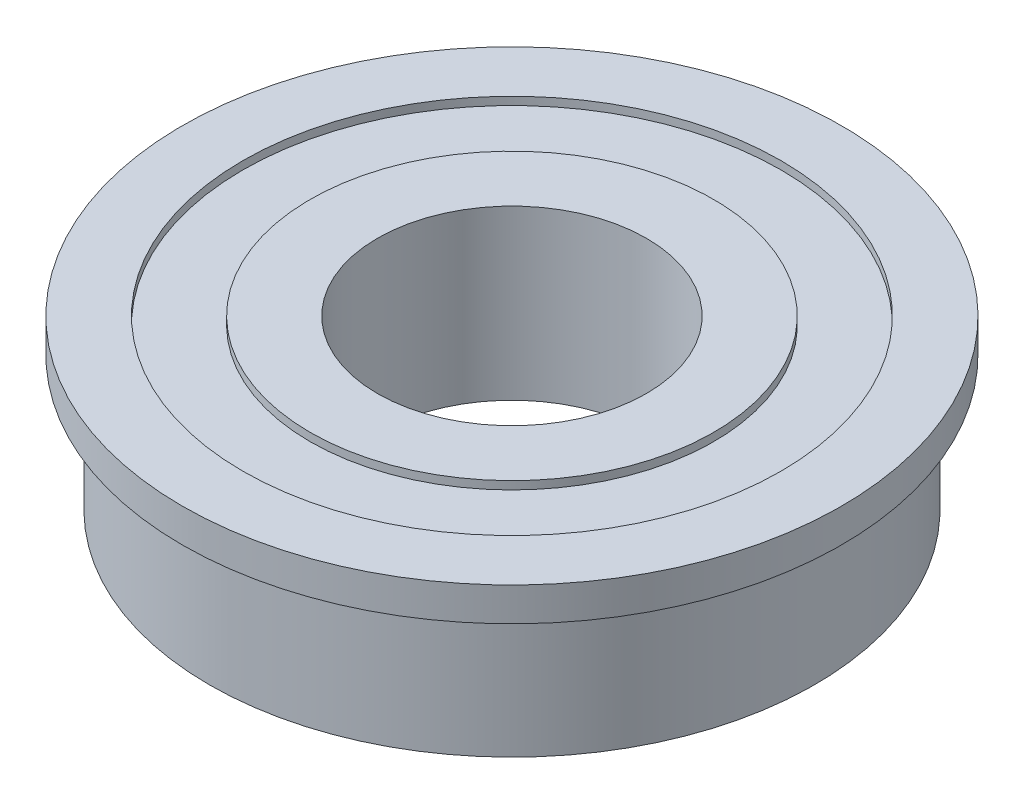
ISO-10303-21;
HEADER;
FILE_DESCRIPTION(('STEP AP214'),'2;1');
FILE_NAME('part.step','',(''),(''),'','','');
FILE_SCHEMA(('AUTOMOTIVE_DESIGN { 1 0 10303 214 1 1 1 1 }'));
ENDSEC;
DATA;
#1=APPLICATION_CONTEXT('core data for automotive mechanical design processes');
#2=APPLICATION_PROTOCOL_DEFINITION('international standard','automotive_design',2000,#1);
#3=PRODUCT_CONTEXT('',#1,'mechanical');
#4=PRODUCT('Part','Part','',(#3));
#5=PRODUCT_RELATED_PRODUCT_CATEGORY('part','',(#4));
#6=PRODUCT_DEFINITION_FORMATION('','',#4);
#7=PRODUCT_DEFINITION_CONTEXT('part definition',#1,'design');
#8=PRODUCT_DEFINITION('design','',#6,#7);
#9=PRODUCT_DEFINITION_SHAPE('','',#8);
#10=(LENGTH_UNIT() NAMED_UNIT(*) SI_UNIT(.MILLI.,.METRE.));
#11=(NAMED_UNIT(*) PLANE_ANGLE_UNIT() SI_UNIT($,.RADIAN.));
#12=(NAMED_UNIT(*) SI_UNIT($,.STERADIAN.) SOLID_ANGLE_UNIT());
#13=UNCERTAINTY_MEASURE_WITH_UNIT(LENGTH_MEASURE(1.E-05),#10,'distance_accuracy_value','');
#14=(GEOMETRIC_REPRESENTATION_CONTEXT(3) GLOBAL_UNCERTAINTY_ASSIGNED_CONTEXT((#13)) GLOBAL_UNIT_ASSIGNED_CONTEXT((#10,
#11,#12)) REPRESENTATION_CONTEXT('',''));
#15=CARTESIAN_POINT('',(0.,0.,0.));
#16=DIRECTION('',(0.,0.,1.));
#17=DIRECTION('',(1.,0.,0.));
#18=AXIS2_PLACEMENT_3D('',#15,#16,#17);
#19=CARTESIAN_POINT('',(0.,0.,0.));
#20=DIRECTION('',(0.,1.,0.));
#21=DIRECTION('',(0.,0.,1.));
#22=AXIS2_PLACEMENT_3D('',#19,#20,#21);
#23=CYLINDRICAL_SURFACE('',#22,12.7);
#24=CARTESIAN_POINT('',(0.,7.9375,0.));
#25=DIRECTION('',(0.,1.,0.));
#26=DIRECTION('',(0.,0.,1.));
#27=AXIS2_PLACEMENT_3D('',#24,#25,#26);
#28=CIRCLE('',#27,12.7);
#29=CARTESIAN_POINT('',(0.,7.9375,12.7));
#30=VERTEX_POINT('',#29);
#31=EDGE_CURVE('E47',#30,#30,#28,.F.);
#32=ORIENTED_EDGE('',*,*,#31,.F.);
#33=EDGE_LOOP('',(#32));
#34=FACE_BOUND('',#33,.T.);
#35=CARTESIAN_POINT('',(0.,7.5565,0.));
#36=DIRECTION('',(0.,1.,0.));
#37=DIRECTION('',(0.,0.,1.));
#38=AXIS2_PLACEMENT_3D('',#35,#36,#37);
#39=CIRCLE('',#38,12.7);
#40=CARTESIAN_POINT('',(0.,7.5565,12.7));
#41=VERTEX_POINT('',#40);
#42=EDGE_CURVE('E19',#41,#41,#39,.T.);
#43=ORIENTED_EDGE('',*,*,#42,.F.);
#44=EDGE_LOOP('',(#43));
#45=FACE_BOUND('',#44,.T.);
#46=ADVANCED_FACE('F16',(#34,#45),#23,.F.);
#47=CARTESIAN_POINT('',(9.525,7.5565,0.));
#48=DIRECTION('',(0.,1.,0.));
#49=DIRECTION('',(0.,0.,1.));
#50=AXIS2_PLACEMENT_3D('',#47,#48,#49);
#51=PLANE('',#50);
#52=CARTESIAN_POINT('',(0.,7.5565,0.));
#53=DIRECTION('',(0.,1.,0.));
#54=DIRECTION('',(0.,0.,1.));
#55=AXIS2_PLACEMENT_3D('',#52,#53,#54);
#56=CIRCLE('',#55,9.525);
#57=CARTESIAN_POINT('',(0.,7.5565,9.525));
#58=VERTEX_POINT('',#57);
#59=EDGE_CURVE('E45',#58,#58,#56,.T.);
#60=ORIENTED_EDGE('',*,*,#59,.F.);
#61=EDGE_LOOP('',(#60));
#62=FACE_BOUND('',#61,.T.);
#63=ORIENTED_EDGE('',*,*,#42,.T.);
#64=EDGE_LOOP('',(#63));
#65=FACE_BOUND('',#64,.T.);
#66=ADVANCED_FACE('F54',(#62,#65),#51,.T.);
#67=CARTESIAN_POINT('',(12.7,7.9375,0.));
#68=DIRECTION('',(0.,1.,0.));
#69=DIRECTION('',(0.,0.,1.));
#70=AXIS2_PLACEMENT_3D('',#67,#68,#69);
#71=PLANE('',#70);
#72=ORIENTED_EDGE('',*,*,#31,.T.);
#73=EDGE_LOOP('',(#72));
#74=FACE_BOUND('',#73,.T.);
#75=CARTESIAN_POINT('',(0.,7.9375,0.));
#76=DIRECTION('',(0.,1.,0.));
#77=DIRECTION('',(0.,0.,1.));
#78=AXIS2_PLACEMENT_3D('',#75,#76,#77);
#79=CIRCLE('',#78,15.5575);
#80=CARTESIAN_POINT('',(0.,7.9375,15.5575));
#81=VERTEX_POINT('',#80);
#82=EDGE_CURVE('E42',#81,#81,#79,.F.);
#83=ORIENTED_EDGE('',*,*,#82,.F.);
#84=EDGE_LOOP('',(#83));
#85=FACE_BOUND('',#84,.T.);
#86=ADVANCED_FACE('F61',(#74,#85),#71,.T.);
#87=CARTESIAN_POINT('',(0.,0.,0.));
#88=DIRECTION('',(0.,1.,0.));
#89=DIRECTION('',(0.,0.,1.));
#90=AXIS2_PLACEMENT_3D('',#87,#88,#89);
#91=CYLINDRICAL_SURFACE('',#90,9.525);
#92=ORIENTED_EDGE('',*,*,#59,.T.);
#93=EDGE_LOOP('',(#92));
#94=FACE_BOUND('',#93,.T.);
#95=CARTESIAN_POINT('',(0.,7.9375,0.));
#96=DIRECTION('',(0.,1.,0.));
#97=DIRECTION('',(0.,0.,1.));
#98=AXIS2_PLACEMENT_3D('',#95,#96,#97);
#99=CIRCLE('',#98,9.525);
#100=CARTESIAN_POINT('',(0.,7.9375,9.525));
#101=VERTEX_POINT('',#100);
#102=EDGE_CURVE('E39',#101,#101,#99,.T.);
#103=ORIENTED_EDGE('',*,*,#102,.F.);
#104=EDGE_LOOP('',(#103));
#105=FACE_BOUND('',#104,.T.);
#106=ADVANCED_FACE('F89',(#94,#105),#91,.T.);
#107=CARTESIAN_POINT('',(0.,0.,0.));
#108=DIRECTION('',(0.,1.,0.));
#109=DIRECTION('',(0.,0.,1.));
#110=AXIS2_PLACEMENT_3D('',#107,#108,#109);
#111=CYLINDRICAL_SURFACE('',#110,15.5575);
#112=CARTESIAN_POINT('',(0.,6.35,0.));
#113=DIRECTION('',(0.,1.,0.));
#114=DIRECTION('',(0.,0.,1.));
#115=AXIS2_PLACEMENT_3D('',#112,#113,#114);
#116=CIRCLE('',#115,15.5575);
#117=CARTESIAN_POINT('',(0.,6.35,15.5575));
#118=VERTEX_POINT('',#117);
#119=EDGE_CURVE('E36',#118,#118,#116,.F.);
#120=ORIENTED_EDGE('',*,*,#119,.F.);
#121=EDGE_LOOP('',(#120));
#122=FACE_BOUND('',#121,.T.);
#123=ORIENTED_EDGE('',*,*,#82,.T.);
#124=EDGE_LOOP('',(#123));
#125=FACE_BOUND('',#124,.T.);
#126=ADVANCED_FACE('F85',(#122,#125),#111,.T.);
#127=CARTESIAN_POINT('',(6.35,7.9375,0.));
#128=DIRECTION('',(0.,1.,0.));
#129=DIRECTION('',(0.,0.,1.));
#130=AXIS2_PLACEMENT_3D('',#127,#128,#129);
#131=PLANE('',#130);
#132=CARTESIAN_POINT('',(0.,7.9375,0.));
#133=DIRECTION('',(0.,1.,0.));
#134=DIRECTION('',(0.,0.,1.));
#135=AXIS2_PLACEMENT_3D('',#132,#133,#134);
#136=CIRCLE('',#135,6.35);
#137=CARTESIAN_POINT('',(0.,7.9375,6.35));
#138=VERTEX_POINT('',#137);
#139=EDGE_CURVE('E33',#138,#138,#136,.F.);
#140=ORIENTED_EDGE('',*,*,#139,.T.);
#141=EDGE_LOOP('',(#140));
#142=FACE_BOUND('',#141,.T.);
#143=ORIENTED_EDGE('',*,*,#102,.T.);
#144=EDGE_LOOP('',(#143));
#145=FACE_BOUND('',#144,.T.);
#146=ADVANCED_FACE('F81',(#142,#145),#131,.T.);
#147=CARTESIAN_POINT('',(15.5575,6.35,0.));
#148=DIRECTION('',(0.,-1.,0.));
#149=DIRECTION('',(0.,0.,-1.));
#150=AXIS2_PLACEMENT_3D('',#147,#148,#149);
#151=PLANE('',#150);
#152=ORIENTED_EDGE('',*,*,#119,.T.);
#153=EDGE_LOOP('',(#152));
#154=FACE_BOUND('',#153,.T.);
#155=CARTESIAN_POINT('',(0.,6.35,0.));
#156=DIRECTION('',(0.,1.,0.));
#157=DIRECTION('',(0.,0.,1.));
#158=AXIS2_PLACEMENT_3D('',#155,#156,#157);
#159=CIRCLE('',#158,14.2875);
#160=CARTESIAN_POINT('',(0.,6.35,14.2875));
#161=VERTEX_POINT('',#160);
#162=EDGE_CURVE('E28',#161,#161,#159,.F.);
#163=ORIENTED_EDGE('',*,*,#162,.F.);
#164=EDGE_LOOP('',(#163));
#165=FACE_BOUND('',#164,.T.);
#166=ADVANCED_FACE('F77',(#154,#165),#151,.T.);
#167=CARTESIAN_POINT('',(0.,0.,0.));
#168=DIRECTION('',(0.,1.,0.));
#169=DIRECTION('',(0.,0.,1.));
#170=AXIS2_PLACEMENT_3D('',#167,#168,#169);
#171=CYLINDRICAL_SURFACE('',#170,6.35);
#172=ORIENTED_EDGE('',*,*,#139,.F.);
#173=EDGE_LOOP('',(#172));
#174=FACE_BOUND('',#173,.T.);
#175=CARTESIAN_POINT('',(0.,0.,0.));
#176=DIRECTION('',(0.,1.,0.));
#177=DIRECTION('',(0.,0.,1.));
#178=AXIS2_PLACEMENT_3D('',#175,#176,#177);
#179=CIRCLE('',#178,6.35);
#180=CARTESIAN_POINT('',(0.,0.,6.35));
#181=VERTEX_POINT('',#180);
#182=EDGE_CURVE('E23',#181,#181,#179,.T.);
#183=ORIENTED_EDGE('',*,*,#182,.F.);
#184=EDGE_LOOP('',(#183));
#185=FACE_BOUND('',#184,.T.);
#186=ADVANCED_FACE('F70',(#174,#185),#171,.F.);
#187=CARTESIAN_POINT('',(0.,0.,0.));
#188=DIRECTION('',(0.,1.,0.));
#189=DIRECTION('',(0.,0.,1.));
#190=AXIS2_PLACEMENT_3D('',#187,#188,#189);
#191=CYLINDRICAL_SURFACE('',#190,14.2875);
#192=CARTESIAN_POINT('',(0.,0.,0.));
#193=DIRECTION('',(0.,1.,0.));
#194=DIRECTION('',(0.,0.,1.));
#195=AXIS2_PLACEMENT_3D('',#192,#193,#194);
#196=CIRCLE('',#195,14.2875);
#197=CARTESIAN_POINT('',(0.,0.,14.2875));
#198=VERTEX_POINT('',#197);
#199=EDGE_CURVE('E10',#198,#198,#196,.F.);
#200=ORIENTED_EDGE('',*,*,#199,.F.);
#201=EDGE_LOOP('',(#200));
#202=FACE_BOUND('',#201,.T.);
#203=ORIENTED_EDGE('',*,*,#162,.T.);
#204=EDGE_LOOP('',(#203));
#205=FACE_BOUND('',#204,.T.);
#206=ADVANCED_FACE('F65',(#202,#205),#191,.T.);
#207=CARTESIAN_POINT('',(14.2875,0.,0.));
#208=DIRECTION('',(0.,-1.,0.));
#209=DIRECTION('',(0.,0.,-1.));
#210=AXIS2_PLACEMENT_3D('',#207,#208,#209);
#211=PLANE('',#210);
#212=ORIENTED_EDGE('',*,*,#199,.T.);
#213=EDGE_LOOP('',(#212));
#214=FACE_BOUND('',#213,.T.);
#215=ORIENTED_EDGE('',*,*,#182,.T.);
#216=EDGE_LOOP('',(#215));
#217=FACE_BOUND('',#216,.T.);
#218=ADVANCED_FACE('F63',(#214,#217),#211,.T.);
#219=CLOSED_SHELL('',(#46,#66,#86,#106,#126,#146,#166,#186,#206,#218));
#220=MANIFOLD_SOLID_BREP('B1',#219);
#221=ADVANCED_BREP_SHAPE_REPRESENTATION('',(#18,#220),#14);
#222=SHAPE_DEFINITION_REPRESENTATION(#9,#221);
ENDSEC;
END-ISO-10303-21;
